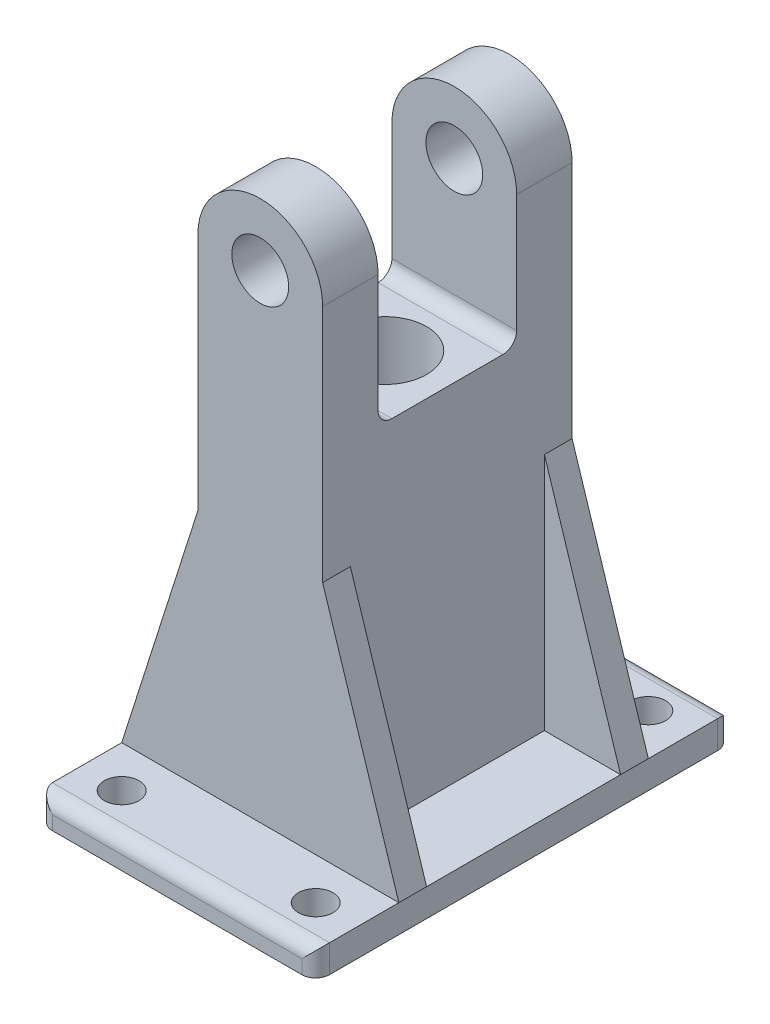
ISO-10303-21;
HEADER;
FILE_DESCRIPTION(('STEP AP214'),'2;1');
FILE_NAME('part.step','',(''),(''),'','','');
FILE_SCHEMA(('AUTOMOTIVE_DESIGN { 1 0 10303 214 1 1 1 1 }'));
ENDSEC;
DATA;
#1=APPLICATION_CONTEXT('core data for automotive mechanical design processes');
#2=APPLICATION_PROTOCOL_DEFINITION('international standard','automotive_design',2000,#1);
#3=PRODUCT_CONTEXT('',#1,'mechanical');
#4=PRODUCT('Part','Part','',(#3));
#5=PRODUCT_RELATED_PRODUCT_CATEGORY('part','',(#4));
#6=PRODUCT_DEFINITION_FORMATION('','',#4);
#7=PRODUCT_DEFINITION_CONTEXT('part definition',#1,'design');
#8=PRODUCT_DEFINITION('design','',#6,#7);
#9=PRODUCT_DEFINITION_SHAPE('','',#8);
#10=(LENGTH_UNIT() NAMED_UNIT(*) SI_UNIT(.MILLI.,.METRE.));
#11=(NAMED_UNIT(*) PLANE_ANGLE_UNIT() SI_UNIT($,.RADIAN.));
#12=(NAMED_UNIT(*) SI_UNIT($,.STERADIAN.) SOLID_ANGLE_UNIT());
#13=UNCERTAINTY_MEASURE_WITH_UNIT(LENGTH_MEASURE(1.E-05),#10,'distance_accuracy_value','');
#14=(GEOMETRIC_REPRESENTATION_CONTEXT(3) GLOBAL_UNCERTAINTY_ASSIGNED_CONTEXT((#13)) GLOBAL_UNIT_ASSIGNED_CONTEXT((#10,
#11,#12)) REPRESENTATION_CONTEXT('',''));
#15=CARTESIAN_POINT('',(0.,0.,0.));
#16=DIRECTION('',(0.,0.,1.));
#17=DIRECTION('',(1.,0.,0.));
#18=AXIS2_PLACEMENT_3D('',#15,#16,#17);
#19=CARTESIAN_POINT('',(0.,-69.,0.));
#20=DIRECTION('',(0.,-1.,0.));
#21=DIRECTION('',(0.,0.,-1.));
#22=AXIS2_PLACEMENT_3D('',#19,#20,#21);
#23=PLANE('',#22);
#24=DIRECTION('',(1.,0.,0.));
#25=VECTOR('',#24,1.);
#26=CARTESIAN_POINT('',(0.,-69.,-14.));
#27=LINE('',#26,#25);
#28=CARTESIAN_POINT('',(8.99999999999999,-69.,-14.));
#29=VERTEX_POINT('',#28);
#30=CARTESIAN_POINT('',(20.,-69.,-14.));
#31=VERTEX_POINT('',#30);
#32=EDGE_CURVE('E223',#29,#31,#27,.T.);
#33=ORIENTED_EDGE('',*,*,#32,.F.);
#34=DIRECTION('',(0.,0.,-1.));
#35=VECTOR('',#34,1.);
#36=CARTESIAN_POINT('',(8.99999999999999,-69.,-18.));
#37=LINE('',#36,#35);
#38=CARTESIAN_POINT('',(8.99999999999999,-69.,14.));
#39=VERTEX_POINT('',#38);
#40=EDGE_CURVE('E244',#39,#29,#37,.T.);
#41=ORIENTED_EDGE('',*,*,#40,.F.);
#42=DIRECTION('',(-1.,0.,0.));
#43=VECTOR('',#42,1.);
#44=CARTESIAN_POINT('',(0.,-69.,14.));
#45=LINE('',#44,#43);
#46=CARTESIAN_POINT('',(20.,-69.,14.));
#47=VERTEX_POINT('',#46);
#48=EDGE_CURVE('E286',#47,#39,#45,.T.);
#49=ORIENTED_EDGE('',*,*,#48,.F.);
#50=DIRECTION('',(0.,0.,1.));
#51=VECTOR('',#50,1.);
#52=CARTESIAN_POINT('',(20.,-69.,-30.));
#53=LINE('',#52,#51);
#54=EDGE_CURVE('E373',#31,#47,#53,.T.);
#55=ORIENTED_EDGE('',*,*,#54,.F.);
#56=EDGE_LOOP('',(#33,#41,#49,#55));
#57=FACE_BOUND('',#56,.T.);
#58=ADVANCED_FACE('F39',(#57),#23,.F.);
#59=CARTESIAN_POINT('',(8.99999999999999,-73.,-18.));
#60=DIRECTION('',(1.,0.,0.));
#61=DIRECTION('',(0.,1.,0.));
#62=AXIS2_PLACEMENT_3D('',#59,#60,#61);
#63=PLANE('',#62);
#64=DIRECTION('',(0.,-1.,0.));
#65=VECTOR('',#64,1.);
#66=CARTESIAN_POINT('',(9.,0.,-14.));
#67=LINE('',#66,#65);
#68=CARTESIAN_POINT('',(8.99999999999999,-34.5,-14.));
#69=VERTEX_POINT('',#68);
#70=EDGE_CURVE('E221',#69,#29,#67,.T.);
#71=ORIENTED_EDGE('',*,*,#70,.F.);
#72=DIRECTION('',(0.,0.,-1.));
#73=VECTOR('',#72,1.);
#74=CARTESIAN_POINT('',(8.99999999999999,-34.5,-14.));
#75=LINE('',#74,#73);
#76=CARTESIAN_POINT('',(8.99999999999999,-34.5,-18.));
#77=VERTEX_POINT('',#76);
#78=EDGE_CURVE('E231',#69,#77,#75,.T.);
#79=ORIENTED_EDGE('',*,*,#78,.T.);
#80=DIRECTION('',(0.,1.,0.));
#81=VECTOR('',#80,1.);
#82=CARTESIAN_POINT('',(8.99999999999999,-73.,-18.));
#83=LINE('',#82,#81);
#84=CARTESIAN_POINT('',(9.,0.,-18.));
#85=VERTEX_POINT('',#84);
#86=EDGE_CURVE('E424',#77,#85,#83,.T.);
#87=ORIENTED_EDGE('',*,*,#86,.T.);
#88=DIRECTION('',(0.,0.,1.));
#89=VECTOR('',#88,1.);
#90=CARTESIAN_POINT('',(9.,0.,-18.));
#91=LINE('',#90,#89);
#92=CARTESIAN_POINT('',(8.99999999999999,0.,-10.));
#93=VERTEX_POINT('',#92);
#94=EDGE_CURVE('E428',#85,#93,#91,.T.);
#95=ORIENTED_EDGE('',*,*,#94,.T.);
#96=DIRECTION('',(0.,-1.,0.));
#97=VECTOR('',#96,1.);
#98=CARTESIAN_POINT('',(8.99999999999999,9.,-10.));
#99=LINE('',#98,#97);
#100=CARTESIAN_POINT('',(8.99999999999999,-17.,-10.));
#101=VERTEX_POINT('',#100);
#102=EDGE_CURVE('E350',#93,#101,#99,.T.);
#103=ORIENTED_EDGE('',*,*,#102,.T.);
#104=CARTESIAN_POINT('',(9.,-17.,-8.));
#105=DIRECTION('',(1.,0.,0.));
#106=DIRECTION('',(0.,1.,0.));
#107=AXIS2_PLACEMENT_3D('',#104,#105,#106);
#108=CIRCLE('',#107,2.);
#109=CARTESIAN_POINT('',(8.99999999999999,-19.,-8.));
#110=VERTEX_POINT('',#109);
#111=EDGE_CURVE('E511',#101,#110,#108,.F.);
#112=ORIENTED_EDGE('',*,*,#111,.T.);
#113=DIRECTION('',(0.,0.,-1.));
#114=VECTOR('',#113,1.);
#115=CARTESIAN_POINT('',(8.99999999999999,-19.,10.));
#116=LINE('',#115,#114);
#117=CARTESIAN_POINT('',(8.99999999999999,-19.,8.));
#118=VERTEX_POINT('',#117);
#119=EDGE_CURVE('E327',#118,#110,#116,.T.);
#120=ORIENTED_EDGE('',*,*,#119,.F.);
#121=CARTESIAN_POINT('',(9.,-17.,8.));
#122=DIRECTION('',(1.,0.,0.));
#123=DIRECTION('',(0.,1.,0.));
#124=AXIS2_PLACEMENT_3D('',#121,#122,#123);
#125=CIRCLE('',#124,2.);
#126=CARTESIAN_POINT('',(8.99999999999999,-17.,10.));
#127=VERTEX_POINT('',#126);
#128=EDGE_CURVE('E49',#118,#127,#125,.F.);
#129=ORIENTED_EDGE('',*,*,#128,.T.);
#130=DIRECTION('',(0.,-1.,0.));
#131=VECTOR('',#130,1.);
#132=CARTESIAN_POINT('',(8.99999999999999,9.,10.));
#133=LINE('',#132,#131);
#134=CARTESIAN_POINT('',(8.99999999999999,0.,10.));
#135=VERTEX_POINT('',#134);
#136=EDGE_CURVE('E338',#135,#127,#133,.T.);
#137=ORIENTED_EDGE('',*,*,#136,.F.);
#138=CARTESIAN_POINT('',(9.,0.,18.));
#139=VERTEX_POINT('',#138);
#140=EDGE_CURVE('E433',#135,#139,#91,.T.);
#141=ORIENTED_EDGE('',*,*,#140,.T.);
#142=DIRECTION('',(0.,1.,0.));
#143=VECTOR('',#142,1.);
#144=CARTESIAN_POINT('',(8.99999999999999,-73.,18.));
#145=LINE('',#144,#143);
#146=CARTESIAN_POINT('',(9.,-34.5,18.));
#147=VERTEX_POINT('',#146);
#148=EDGE_CURVE('E409',#147,#139,#145,.T.);
#149=ORIENTED_EDGE('',*,*,#148,.F.);
#150=DIRECTION('',(0.,0.,1.));
#151=VECTOR('',#150,1.);
#152=CARTESIAN_POINT('',(9.,-34.5,14.));
#153=LINE('',#152,#151);
#154=CARTESIAN_POINT('',(9.,-34.5,14.));
#155=VERTEX_POINT('',#154);
#156=EDGE_CURVE('E296',#155,#147,#153,.T.);
#157=ORIENTED_EDGE('',*,*,#156,.F.);
#158=DIRECTION('',(0.,1.,0.));
#159=VECTOR('',#158,1.);
#160=CARTESIAN_POINT('',(9.,0.,14.));
#161=LINE('',#160,#159);
#162=EDGE_CURVE('E278',#39,#155,#161,.T.);
#163=ORIENTED_EDGE('',*,*,#162,.F.);
#164=ORIENTED_EDGE('',*,*,#40,.T.);
#165=EDGE_LOOP('',(#71,#79,#87,#95,#103,#112,#120,#129,#137,#141,#149,#157,#163,#164));
#166=FACE_BOUND('',#165,.T.);
#167=ADVANCED_FACE('F241',(#166),#63,.T.);
#168=DIRECTION('',(1.,0.,0.));
#169=VECTOR('',#168,1.);
#170=CARTESIAN_POINT('',(0.,-69.,-14.));
#171=LINE('',#170,#169);
#172=CARTESIAN_POINT('',(-20.,-69.,-14.));
#173=VERTEX_POINT('',#172);
#174=CARTESIAN_POINT('',(-9.,-69.,-14.));
#175=VERTEX_POINT('',#174);
#176=EDGE_CURVE('E263',#173,#175,#171,.T.);
#177=ORIENTED_EDGE('',*,*,#176,.F.);
#178=DIRECTION('',(0.,0.,-1.));
#179=VECTOR('',#178,1.);
#180=CARTESIAN_POINT('',(-20.,-69.,-30.));
#181=LINE('',#180,#179);
#182=CARTESIAN_POINT('',(-20.,-69.,14.));
#183=VERTEX_POINT('',#182);
#184=EDGE_CURVE('E367',#183,#173,#181,.T.);
#185=ORIENTED_EDGE('',*,*,#184,.F.);
#186=DIRECTION('',(-1.,0.,0.));
#187=VECTOR('',#186,1.);
#188=CARTESIAN_POINT('',(0.,-69.,14.));
#189=LINE('',#188,#187);
#190=CARTESIAN_POINT('',(-9.,-69.,14.));
#191=VERTEX_POINT('',#190);
#192=EDGE_CURVE('E308',#191,#183,#189,.T.);
#193=ORIENTED_EDGE('',*,*,#192,.F.);
#194=DIRECTION('',(0.,0.,1.));
#195=VECTOR('',#194,1.);
#196=CARTESIAN_POINT('',(-8.99999999999999,-69.,-18.));
#197=LINE('',#196,#195);
#198=EDGE_CURVE('E372',#175,#191,#197,.T.);
#199=ORIENTED_EDGE('',*,*,#198,.F.);
#200=EDGE_LOOP('',(#177,#185,#193,#199));
#201=FACE_BOUND('',#200,.T.);
#202=ADVANCED_FACE('F628',(#201),#23,.F.);
#203=CARTESIAN_POINT('',(-9.,0.,-18.));
#204=DIRECTION('',(-1.,0.,0.));
#205=DIRECTION('',(0.,-1.,0.));
#206=AXIS2_PLACEMENT_3D('',#203,#204,#205);
#207=PLANE('',#206);
#208=DIRECTION('',(0.,-1.,0.));
#209=VECTOR('',#208,1.);
#210=CARTESIAN_POINT('',(-9.,0.,-18.));
#211=LINE('',#210,#209);
#212=CARTESIAN_POINT('',(-9.,0.,-18.));
#213=VERTEX_POINT('',#212);
#214=CARTESIAN_POINT('',(-9.00000000000001,-34.5,-18.));
#215=VERTEX_POINT('',#214);
#216=EDGE_CURVE('E420',#213,#215,#211,.T.);
#217=ORIENTED_EDGE('',*,*,#216,.T.);
#218=DIRECTION('',(0.,0.,-1.));
#219=VECTOR('',#218,1.);
#220=CARTESIAN_POINT('',(-9.00000000000001,-34.5,-14.));
#221=LINE('',#220,#219);
#222=CARTESIAN_POINT('',(-9.00000000000001,-34.5,-14.));
#223=VERTEX_POINT('',#222);
#224=EDGE_CURVE('E273',#223,#215,#221,.T.);
#225=ORIENTED_EDGE('',*,*,#224,.F.);
#226=DIRECTION('',(0.,1.,0.));
#227=VECTOR('',#226,1.);
#228=CARTESIAN_POINT('',(-9.,0.,-14.));
#229=LINE('',#228,#227);
#230=EDGE_CURVE('E256',#175,#223,#229,.T.);
#231=ORIENTED_EDGE('',*,*,#230,.F.);
#232=ORIENTED_EDGE('',*,*,#198,.T.);
#233=DIRECTION('',(0.,-1.,0.));
#234=VECTOR('',#233,1.);
#235=CARTESIAN_POINT('',(-9.,0.,14.));
#236=LINE('',#235,#234);
#237=CARTESIAN_POINT('',(-9.,-34.5,14.));
#238=VERTEX_POINT('',#237);
#239=EDGE_CURVE('E304',#238,#191,#236,.T.);
#240=ORIENTED_EDGE('',*,*,#239,.F.);
#241=DIRECTION('',(0.,0.,1.));
#242=VECTOR('',#241,1.);
#243=CARTESIAN_POINT('',(-9.,-34.5,14.));
#244=LINE('',#243,#242);
#245=CARTESIAN_POINT('',(-9.,-34.5,18.));
#246=VERTEX_POINT('',#245);
#247=EDGE_CURVE('E318',#238,#246,#244,.T.);
#248=ORIENTED_EDGE('',*,*,#247,.T.);
#249=DIRECTION('',(0.,-1.,0.));
#250=VECTOR('',#249,1.);
#251=CARTESIAN_POINT('',(-9.,0.,18.));
#252=LINE('',#251,#250);
#253=CARTESIAN_POINT('',(-9.,0.,18.));
#254=VERTEX_POINT('',#253);
#255=EDGE_CURVE('E405',#254,#246,#252,.T.);
#256=ORIENTED_EDGE('',*,*,#255,.F.);
#257=DIRECTION('',(0.,0.,1.));
#258=VECTOR('',#257,1.);
#259=CARTESIAN_POINT('',(-9.,0.,-18.));
#260=LINE('',#259,#258);
#261=CARTESIAN_POINT('',(-9.,0.,10.));
#262=VERTEX_POINT('',#261);
#263=EDGE_CURVE('E427',#262,#254,#260,.T.);
#264=ORIENTED_EDGE('',*,*,#263,.F.);
#265=DIRECTION('',(0.,-1.,0.));
#266=VECTOR('',#265,1.);
#267=CARTESIAN_POINT('',(-8.99999999999999,9.,10.));
#268=LINE('',#267,#266);
#269=CARTESIAN_POINT('',(-8.99999999999999,-17.,10.));
#270=VERTEX_POINT('',#269);
#271=EDGE_CURVE('E342',#262,#270,#268,.T.);
#272=ORIENTED_EDGE('',*,*,#271,.T.);
#273=CARTESIAN_POINT('',(-9.,-17.,8.));
#274=DIRECTION('',(-1.,0.,0.));
#275=DIRECTION('',(0.,-1.,0.));
#276=AXIS2_PLACEMENT_3D('',#273,#274,#275);
#277=CIRCLE('',#276,2.);
#278=CARTESIAN_POINT('',(-8.99999999999999,-19.,8.));
#279=VERTEX_POINT('',#278);
#280=EDGE_CURVE('E11',#270,#279,#277,.F.);
#281=ORIENTED_EDGE('',*,*,#280,.T.);
#282=DIRECTION('',(0.,0.,1.));
#283=VECTOR('',#282,1.);
#284=CARTESIAN_POINT('',(-8.99999999999999,-19.,10.));
#285=LINE('',#284,#283);
#286=CARTESIAN_POINT('',(-8.99999999999999,-19.,-8.));
#287=VERTEX_POINT('',#286);
#288=EDGE_CURVE('E334',#287,#279,#285,.T.);
#289=ORIENTED_EDGE('',*,*,#288,.F.);
#290=CARTESIAN_POINT('',(-9.,-17.,-8.));
#291=DIRECTION('',(-1.,0.,0.));
#292=DIRECTION('',(0.,-1.,0.));
#293=AXIS2_PLACEMENT_3D('',#290,#291,#292);
#294=CIRCLE('',#293,2.);
#295=CARTESIAN_POINT('',(-8.99999999999999,-17.,-10.));
#296=VERTEX_POINT('',#295);
#297=EDGE_CURVE('E508',#287,#296,#294,.F.);
#298=ORIENTED_EDGE('',*,*,#297,.T.);
#299=DIRECTION('',(0.,-1.,0.));
#300=VECTOR('',#299,1.);
#301=CARTESIAN_POINT('',(-8.99999999999999,9.,-10.));
#302=LINE('',#301,#300);
#303=CARTESIAN_POINT('',(-8.99999999999999,0.,-10.));
#304=VERTEX_POINT('',#303);
#305=EDGE_CURVE('E346',#304,#296,#302,.T.);
#306=ORIENTED_EDGE('',*,*,#305,.F.);
#307=EDGE_CURVE('E434',#213,#304,#260,.T.);
#308=ORIENTED_EDGE('',*,*,#307,.F.);
#309=EDGE_LOOP('',(#217,#225,#231,#232,#240,#248,#256,#264,#272,#281,#289,#298,#306,#308));
#310=FACE_BOUND('',#309,.T.);
#311=ADVANCED_FACE('F575',(#310),#207,.T.);
#312=CARTESIAN_POINT('',(14.,-69.,-24.));
#313=DIRECTION('',(0.,1.,0.));
#314=DIRECTION('',(0.,0.,1.));
#315=AXIS2_PLACEMENT_3D('',#312,#313,#314);
#316=CIRCLE('',#315,2.5);
#317=CARTESIAN_POINT('',(14.,-69.,-21.5));
#318=VERTEX_POINT('',#317);
#319=EDGE_CURVE('E1040',#318,#318,#316,.T.);
#320=ORIENTED_EDGE('',*,*,#319,.F.);
#321=EDGE_LOOP('',(#320));
#322=FACE_BOUND('',#321,.T.);
#323=CARTESIAN_POINT('',(-14.,-69.,-24.));
#324=DIRECTION('',(0.,1.,0.));
#325=DIRECTION('',(0.,0.,-1.));
#326=AXIS2_PLACEMENT_3D('',#323,#324,#325);
#327=CIRCLE('',#326,2.5);
#328=CARTESIAN_POINT('',(-14.,-69.,-26.5));
#329=VERTEX_POINT('',#328);
#330=EDGE_CURVE('E1031',#329,#329,#327,.T.);
#331=ORIENTED_EDGE('',*,*,#330,.F.);
#332=EDGE_LOOP('',(#331));
#333=FACE_BOUND('',#332,.T.);
#334=CARTESIAN_POINT('',(20.,-69.,-28.));
#335=VERTEX_POINT('',#334);
#336=CARTESIAN_POINT('',(20.,-69.,-18.));
#337=VERTEX_POINT('',#336);
#338=EDGE_CURVE('E369',#335,#337,#53,.T.);
#339=ORIENTED_EDGE('',*,*,#338,.F.);
#340=DIRECTION('',(1.,0.,0.));
#341=VECTOR('',#340,1.);
#342=CARTESIAN_POINT('',(-20.,-69.,-28.));
#343=LINE('',#342,#341);
#344=CARTESIAN_POINT('',(-20.,-69.,-28.));
#345=VERTEX_POINT('',#344);
#346=EDGE_CURVE('E488',#335,#345,#343,.F.);
#347=ORIENTED_EDGE('',*,*,#346,.T.);
#348=CARTESIAN_POINT('',(-20.,-69.,-18.));
#349=VERTEX_POINT('',#348);
#350=EDGE_CURVE('E368',#349,#345,#181,.T.);
#351=ORIENTED_EDGE('',*,*,#350,.F.);
#352=DIRECTION('',(1.,0.,0.));
#353=VECTOR('',#352,1.);
#354=CARTESIAN_POINT('',(0.,-69.,-18.));
#355=LINE('',#354,#353);
#356=EDGE_CURVE('E393',#349,#337,#355,.T.);
#357=ORIENTED_EDGE('',*,*,#356,.T.);
#358=EDGE_LOOP('',(#339,#347,#351,#357));
#359=FACE_BOUND('',#358,.T.);
#360=ADVANCED_FACE('F549',(#322,#333,#359),#23,.F.);
#361=CARTESIAN_POINT('',(14.,-69.,24.));
#362=DIRECTION('',(0.,1.,0.));
#363=DIRECTION('',(0.,0.,-1.));
#364=AXIS2_PLACEMENT_3D('',#361,#362,#363);
#365=CIRCLE('',#364,2.5);
#366=CARTESIAN_POINT('',(14.,-69.,21.5));
#367=VERTEX_POINT('',#366);
#368=EDGE_CURVE('E523',#367,#367,#365,.T.);
#369=ORIENTED_EDGE('',*,*,#368,.F.);
#370=EDGE_LOOP('',(#369));
#371=FACE_BOUND('',#370,.T.);
#372=CARTESIAN_POINT('',(-14.,-69.,24.));
#373=DIRECTION('',(0.,1.,0.));
#374=DIRECTION('',(0.,0.,1.));
#375=AXIS2_PLACEMENT_3D('',#372,#373,#374);
#376=CIRCLE('',#375,2.5);
#377=CARTESIAN_POINT('',(-14.,-69.,26.5));
#378=VERTEX_POINT('',#377);
#379=EDGE_CURVE('E652',#378,#378,#376,.T.);
#380=ORIENTED_EDGE('',*,*,#379,.F.);
#381=EDGE_LOOP('',(#380));
#382=FACE_BOUND('',#381,.T.);
#383=CARTESIAN_POINT('',(-20.,-69.,28.));
#384=VERTEX_POINT('',#383);
#385=CARTESIAN_POINT('',(-20.,-69.,18.));
#386=VERTEX_POINT('',#385);
#387=EDGE_CURVE('E363',#384,#386,#181,.T.);
#388=ORIENTED_EDGE('',*,*,#387,.F.);
#389=DIRECTION('',(-1.,0.,0.));
#390=VECTOR('',#389,1.);
#391=CARTESIAN_POINT('',(20.,-69.,28.));
#392=LINE('',#391,#390);
#393=CARTESIAN_POINT('',(20.,-69.,28.));
#394=VERTEX_POINT('',#393);
#395=EDGE_CURVE('E505',#384,#394,#392,.F.);
#396=ORIENTED_EDGE('',*,*,#395,.T.);
#397=CARTESIAN_POINT('',(20.,-69.,18.));
#398=VERTEX_POINT('',#397);
#399=EDGE_CURVE('E366',#398,#394,#53,.T.);
#400=ORIENTED_EDGE('',*,*,#399,.F.);
#401=DIRECTION('',(1.,0.,0.));
#402=VECTOR('',#401,1.);
#403=CARTESIAN_POINT('',(0.,-69.,18.));
#404=LINE('',#403,#402);
#405=EDGE_CURVE('E432',#386,#398,#404,.T.);
#406=ORIENTED_EDGE('',*,*,#405,.F.);
#407=EDGE_LOOP('',(#388,#396,#400,#406));
#408=FACE_BOUND('',#407,.T.);
#409=ADVANCED_FACE('F629',(#371,#382,#408),#23,.F.);
#410=CARTESIAN_POINT('',(0.,0.,-18.));
#411=DIRECTION('',(0.,0.,1.));
#412=DIRECTION('',(1.,0.,0.));
#413=AXIS2_PLACEMENT_3D('',#410,#411,#412);
#414=CYLINDRICAL_SURFACE('',#413,9.);
#415=ORIENTED_EDGE('',*,*,#307,.T.);
#416=CARTESIAN_POINT('',(0.,0.,-10.));
#417=DIRECTION('',(0.,0.,1.));
#418=DIRECTION('',(1.,0.,0.));
#419=AXIS2_PLACEMENT_3D('',#416,#417,#418);
#420=CIRCLE('',#419,9.);
#421=EDGE_CURVE('E359',#304,#93,#420,.F.);
#422=ORIENTED_EDGE('',*,*,#421,.T.);
#423=ORIENTED_EDGE('',*,*,#94,.F.);
#424=CARTESIAN_POINT('',(0.,0.,-18.));
#425=DIRECTION('',(0.,0.,1.));
#426=DIRECTION('',(1.,0.,0.));
#427=AXIS2_PLACEMENT_3D('',#424,#425,#426);
#428=CIRCLE('',#427,9.);
#429=EDGE_CURVE('E416',#85,#213,#428,.T.);
#430=ORIENTED_EDGE('',*,*,#429,.T.);
#431=EDGE_LOOP('',(#415,#422,#423,#430));
#432=FACE_BOUND('',#431,.T.);
#433=ADVANCED_FACE('F558',(#432),#414,.T.);
#434=ORIENTED_EDGE('',*,*,#140,.F.);
#435=CARTESIAN_POINT('',(0.,0.,10.));
#436=DIRECTION('',(0.,0.,-1.));
#437=DIRECTION('',(-1.,0.,0.));
#438=AXIS2_PLACEMENT_3D('',#435,#436,#437);
#439=CIRCLE('',#438,9.);
#440=EDGE_CURVE('E355',#135,#262,#439,.F.);
#441=ORIENTED_EDGE('',*,*,#440,.T.);
#442=ORIENTED_EDGE('',*,*,#263,.T.);
#443=CARTESIAN_POINT('',(0.,0.,18.));
#444=DIRECTION('',(0.,0.,1.));
#445=DIRECTION('',(1.,0.,0.));
#446=AXIS2_PLACEMENT_3D('',#443,#444,#445);
#447=CIRCLE('',#446,9.);
#448=EDGE_CURVE('E401',#139,#254,#447,.T.);
#449=ORIENTED_EDGE('',*,*,#448,.F.);
#450=EDGE_LOOP('',(#434,#441,#442,#449));
#451=FACE_BOUND('',#450,.T.);
#452=ADVANCED_FACE('F589',(#451),#414,.T.);
#453=CARTESIAN_POINT('',(0.,0.,-18.));
#454=DIRECTION('',(0.,0.,1.));
#455=DIRECTION('',(1.,0.,0.));
#456=AXIS2_PLACEMENT_3D('',#453,#454,#455);
#457=CYLINDRICAL_SURFACE('',#456,4.1);
#458=CARTESIAN_POINT('',(0.,0.,-18.));
#459=DIRECTION('',(0.,0.,1.));
#460=DIRECTION('',(1.,0.,0.));
#461=AXIS2_PLACEMENT_3D('',#458,#459,#460);
#462=CIRCLE('',#461,4.1);
#463=CARTESIAN_POINT('',(4.1,0.,-18.));
#464=VERTEX_POINT('',#463);
#465=EDGE_CURVE('E412',#464,#464,#462,.T.);
#466=ORIENTED_EDGE('',*,*,#465,.F.);
#467=EDGE_LOOP('',(#466));
#468=FACE_BOUND('',#467,.T.);
#469=CARTESIAN_POINT('',(0.,0.,-10.));
#470=DIRECTION('',(0.,0.,1.));
#471=DIRECTION('',(1.,0.,0.));
#472=AXIS2_PLACEMENT_3D('',#469,#470,#471);
#473=CIRCLE('',#472,4.1);
#474=CARTESIAN_POINT('',(4.1,0.,-10.));
#475=VERTEX_POINT('',#474);
#476=EDGE_CURVE('E358',#475,#475,#473,.F.);
#477=ORIENTED_EDGE('',*,*,#476,.F.);
#478=EDGE_LOOP('',(#477));
#479=FACE_BOUND('',#478,.T.);
#480=ADVANCED_FACE('F671',(#468,#479),#457,.F.);
#481=CARTESIAN_POINT('',(0.,0.,18.));
#482=DIRECTION('',(0.,0.,1.));
#483=DIRECTION('',(1.,0.,0.));
#484=AXIS2_PLACEMENT_3D('',#481,#482,#483);
#485=CIRCLE('',#484,4.1);
#486=CARTESIAN_POINT('',(4.1,0.,18.));
#487=VERTEX_POINT('',#486);
#488=EDGE_CURVE('E397',#487,#487,#485,.T.);
#489=ORIENTED_EDGE('',*,*,#488,.T.);
#490=EDGE_LOOP('',(#489));
#491=FACE_BOUND('',#490,.T.);
#492=CARTESIAN_POINT('',(0.,0.,10.));
#493=DIRECTION('',(0.,0.,-1.));
#494=DIRECTION('',(-1.,0.,0.));
#495=AXIS2_PLACEMENT_3D('',#492,#493,#494);
#496=CIRCLE('',#495,4.1);
#497=CARTESIAN_POINT('',(-4.1,0.,10.));
#498=VERTEX_POINT('',#497);
#499=EDGE_CURVE('E354',#498,#498,#496,.F.);
#500=ORIENTED_EDGE('',*,*,#499,.F.);
#501=EDGE_LOOP('',(#500));
#502=FACE_BOUND('',#501,.T.);
#503=ADVANCED_FACE('F674',(#491,#502),#457,.F.);
#504=CARTESIAN_POINT('',(0.,0.,-18.));
#505=DIRECTION('',(0.,0.,1.));
#506=DIRECTION('',(1.,0.,0.));
#507=AXIS2_PLACEMENT_3D('',#504,#505,#506);
#508=PLANE('',#507);
#509=ORIENTED_EDGE('',*,*,#465,.T.);
#510=EDGE_LOOP('',(#509));
#511=FACE_BOUND('',#510,.T.);
#512=ORIENTED_EDGE('',*,*,#356,.F.);
#513=DIRECTION('',(-0.303773534632601,-0.952744267711339,0.));
#514=VECTOR('',#513,1.);
#515=CARTESIAN_POINT('',(1.81544327931362,-0.578836987607242,-18.));
#516=LINE('',#515,#514);
#517=EDGE_CURVE('E237',#215,#349,#516,.T.);
#518=ORIENTED_EDGE('',*,*,#517,.F.);
#519=ORIENTED_EDGE('',*,*,#216,.F.);
#520=ORIENTED_EDGE('',*,*,#429,.F.);
#521=ORIENTED_EDGE('',*,*,#86,.F.);
#522=DIRECTION('',(-0.303773534632601,0.952744267711339,0.));
#523=VECTOR('',#522,1.);
#524=CARTESIAN_POINT('',(-1.81544327931365,-0.578836987607252,-18.));
#525=LINE('',#524,#523);
#526=EDGE_CURVE('E228',#337,#77,#525,.T.);
#527=ORIENTED_EDGE('',*,*,#526,.F.);
#528=EDGE_LOOP('',(#512,#518,#519,#520,#521,#527));
#529=FACE_BOUND('',#528,.T.);
#530=ADVANCED_FACE('F553',(#511,#529),#508,.F.);
#531=CARTESIAN_POINT('',(0.,0.,18.));
#532=DIRECTION('',(0.,0.,1.));
#533=DIRECTION('',(1.,0.,0.));
#534=AXIS2_PLACEMENT_3D('',#531,#532,#533);
#535=PLANE('',#534);
#536=ORIENTED_EDGE('',*,*,#488,.F.);
#537=EDGE_LOOP('',(#536));
#538=FACE_BOUND('',#537,.T.);
#539=ORIENTED_EDGE('',*,*,#255,.T.);
#540=DIRECTION('',(0.303773534632601,0.952744267711339,0.));
#541=VECTOR('',#540,1.);
#542=CARTESIAN_POINT('',(1.81544327931362,-0.578836987607242,18.));
#543=LINE('',#542,#541);
#544=EDGE_CURVE('E300',#386,#246,#543,.T.);
#545=ORIENTED_EDGE('',*,*,#544,.F.);
#546=ORIENTED_EDGE('',*,*,#405,.T.);
#547=DIRECTION('',(0.303773534632601,-0.952744267711339,0.));
#548=VECTOR('',#547,1.);
#549=CARTESIAN_POINT('',(-1.81544327931365,-0.578836987607252,18.));
#550=LINE('',#549,#548);
#551=EDGE_CURVE('E277',#147,#398,#550,.T.);
#552=ORIENTED_EDGE('',*,*,#551,.F.);
#553=ORIENTED_EDGE('',*,*,#148,.T.);
#554=ORIENTED_EDGE('',*,*,#448,.T.);
#555=EDGE_LOOP('',(#539,#545,#546,#552,#553,#554));
#556=FACE_BOUND('',#555,.T.);
#557=ADVANCED_FACE('F664',(#538,#556),#535,.T.);
#558=CARTESIAN_POINT('',(-20.,-69.,-30.));
#559=DIRECTION('',(-1.,0.,0.));
#560=DIRECTION('',(0.,0.,1.));
#561=AXIS2_PLACEMENT_3D('',#558,#559,#560);
#562=PLANE('',#561);
#563=ORIENTED_EDGE('',*,*,#350,.T.);
#564=DIRECTION('',(0.,-1.,0.));
#565=VECTOR('',#564,1.);
#566=CARTESIAN_POINT('',(-20.,-69.,-28.));
#567=LINE('',#566,#565);
#568=CARTESIAN_POINT('',(-20.,-73.,-28.));
#569=VERTEX_POINT('',#568);
#570=EDGE_CURVE('E463',#345,#569,#567,.T.);
#571=ORIENTED_EDGE('',*,*,#570,.T.);
#572=DIRECTION('',(0.,0.,-1.));
#573=VECTOR('',#572,1.);
#574=CARTESIAN_POINT('',(-20.,-73.,-30.));
#575=LINE('',#574,#573);
#576=CARTESIAN_POINT('',(-20.,-73.,28.));
#577=VERTEX_POINT('',#576);
#578=EDGE_CURVE('E362',#577,#569,#575,.T.);
#579=ORIENTED_EDGE('',*,*,#578,.F.);
#580=DIRECTION('',(0.,-1.,0.));
#581=VECTOR('',#580,1.);
#582=CARTESIAN_POINT('',(-20.,-69.,28.));
#583=LINE('',#582,#581);
#584=EDGE_CURVE('E460',#577,#384,#583,.F.);
#585=ORIENTED_EDGE('',*,*,#584,.T.);
#586=ORIENTED_EDGE('',*,*,#387,.T.);
#587=DIRECTION('',(0.,0.,1.));
#588=VECTOR('',#587,1.);
#589=CARTESIAN_POINT('',(-20.,-69.,14.));
#590=LINE('',#589,#588);
#591=EDGE_CURVE('E312',#183,#386,#590,.T.);
#592=ORIENTED_EDGE('',*,*,#591,.F.);
#593=ORIENTED_EDGE('',*,*,#184,.T.);
#594=DIRECTION('',(0.,0.,-1.));
#595=VECTOR('',#594,1.);
#596=CARTESIAN_POINT('',(-20.,-69.,-14.));
#597=LINE('',#596,#595);
#598=EDGE_CURVE('E266',#173,#349,#597,.T.);
#599=ORIENTED_EDGE('',*,*,#598,.T.);
#600=EDGE_LOOP('',(#563,#571,#579,#585,#586,#592,#593,#599));
#601=FACE_BOUND('',#600,.T.);
#602=ADVANCED_FACE('F602',(#601),#562,.T.);
#603=CARTESIAN_POINT('',(20.,-69.,30.));
#604=DIRECTION('',(0.,0.,1.));
#605=DIRECTION('',(1.,0.,0.));
#606=AXIS2_PLACEMENT_3D('',#603,#604,#605);
#607=PLANE('',#606);
#608=DIRECTION('',(-1.,0.,0.));
#609=VECTOR('',#608,1.);
#610=CARTESIAN_POINT('',(20.,-73.,30.));
#611=LINE('',#610,#609);
#612=CARTESIAN_POINT('',(18.,-73.,30.));
#613=VERTEX_POINT('',#612);
#614=CARTESIAN_POINT('',(-18.,-73.,30.));
#615=VERTEX_POINT('',#614);
#616=EDGE_CURVE('E385',#613,#615,#611,.T.);
#617=ORIENTED_EDGE('',*,*,#616,.F.);
#618=DIRECTION('',(0.,-1.,0.));
#619=VECTOR('',#618,1.);
#620=CARTESIAN_POINT('',(18.,-69.,30.));
#621=LINE('',#620,#619);
#622=CARTESIAN_POINT('',(18.,-71.,30.));
#623=VERTEX_POINT('',#622);
#624=EDGE_CURVE('E57',#613,#623,#621,.F.);
#625=ORIENTED_EDGE('',*,*,#624,.T.);
#626=DIRECTION('',(-1.,0.,0.));
#627=VECTOR('',#626,1.);
#628=CARTESIAN_POINT('',(-20.,-71.,30.));
#629=LINE('',#628,#627);
#630=CARTESIAN_POINT('',(-18.,-71.,30.));
#631=VERTEX_POINT('',#630);
#632=EDGE_CURVE('E500',#623,#631,#629,.T.);
#633=ORIENTED_EDGE('',*,*,#632,.T.);
#634=DIRECTION('',(0.,-1.,0.));
#635=VECTOR('',#634,1.);
#636=CARTESIAN_POINT('',(-18.,-69.,30.));
#637=LINE('',#636,#635);
#638=EDGE_CURVE('E497',#631,#615,#637,.T.);
#639=ORIENTED_EDGE('',*,*,#638,.T.);
#640=EDGE_LOOP('',(#617,#625,#633,#639));
#641=FACE_BOUND('',#640,.T.);
#642=ADVANCED_FACE('F622',(#641),#607,.T.);
#643=CARTESIAN_POINT('',(20.,-69.,-30.));
#644=DIRECTION('',(1.,0.,0.));
#645=DIRECTION('',(0.,0.,-1.));
#646=AXIS2_PLACEMENT_3D('',#643,#644,#645);
#647=PLANE('',#646);
#648=DIRECTION('',(0.,0.,1.));
#649=VECTOR('',#648,1.);
#650=CARTESIAN_POINT('',(20.,-73.,-30.));
#651=LINE('',#650,#649);
#652=CARTESIAN_POINT('',(20.,-73.,-28.));
#653=VERTEX_POINT('',#652);
#654=CARTESIAN_POINT('',(20.,-73.,28.));
#655=VERTEX_POINT('',#654);
#656=EDGE_CURVE('E381',#653,#655,#651,.T.);
#657=ORIENTED_EDGE('',*,*,#656,.F.);
#658=DIRECTION('',(0.,-1.,0.));
#659=VECTOR('',#658,1.);
#660=CARTESIAN_POINT('',(20.,-69.,-28.));
#661=LINE('',#660,#659);
#662=EDGE_CURVE('E494',#653,#335,#661,.F.);
#663=ORIENTED_EDGE('',*,*,#662,.T.);
#664=ORIENTED_EDGE('',*,*,#338,.T.);
#665=DIRECTION('',(0.,0.,-1.));
#666=VECTOR('',#665,1.);
#667=CARTESIAN_POINT('',(20.,-69.,-14.));
#668=LINE('',#667,#666);
#669=EDGE_CURVE('E238',#31,#337,#668,.T.);
#670=ORIENTED_EDGE('',*,*,#669,.F.);
#671=ORIENTED_EDGE('',*,*,#54,.T.);
#672=DIRECTION('',(0.,0.,1.));
#673=VECTOR('',#672,1.);
#674=CARTESIAN_POINT('',(20.,-69.,14.));
#675=LINE('',#674,#673);
#676=EDGE_CURVE('E289',#47,#398,#675,.T.);
#677=ORIENTED_EDGE('',*,*,#676,.T.);
#678=ORIENTED_EDGE('',*,*,#399,.T.);
#679=DIRECTION('',(0.,-1.,0.));
#680=VECTOR('',#679,1.);
#681=CARTESIAN_POINT('',(20.,-69.,28.));
#682=LINE('',#681,#680);
#683=EDGE_CURVE('E491',#394,#655,#682,.T.);
#684=ORIENTED_EDGE('',*,*,#683,.T.);
#685=EDGE_LOOP('',(#657,#663,#664,#670,#671,#677,#678,#684));
#686=FACE_BOUND('',#685,.T.);
#687=ADVANCED_FACE('F534',(#686),#647,.T.);
#688=CARTESIAN_POINT('',(20.,-69.,-30.));
#689=DIRECTION('',(0.,0.,-1.));
#690=DIRECTION('',(-1.,0.,0.));
#691=AXIS2_PLACEMENT_3D('',#688,#689,#690);
#692=PLANE('',#691);
#693=DIRECTION('',(1.,0.,0.));
#694=VECTOR('',#693,1.);
#695=CARTESIAN_POINT('',(20.,-73.,-30.));
#696=LINE('',#695,#694);
#697=CARTESIAN_POINT('',(-18.,-73.,-30.));
#698=VERTEX_POINT('',#697);
#699=CARTESIAN_POINT('',(18.,-73.,-30.));
#700=VERTEX_POINT('',#699);
#701=EDGE_CURVE('E377',#698,#700,#696,.T.);
#702=ORIENTED_EDGE('',*,*,#701,.F.);
#703=DIRECTION('',(0.,-1.,0.));
#704=VECTOR('',#703,1.);
#705=CARTESIAN_POINT('',(-18.,-69.,-30.));
#706=LINE('',#705,#704);
#707=CARTESIAN_POINT('',(-18.,-71.,-30.));
#708=VERTEX_POINT('',#707);
#709=EDGE_CURVE('E485',#698,#708,#706,.F.);
#710=ORIENTED_EDGE('',*,*,#709,.T.);
#711=DIRECTION('',(1.,0.,0.));
#712=VECTOR('',#711,1.);
#713=CARTESIAN_POINT('',(20.,-71.,-30.));
#714=LINE('',#713,#712);
#715=CARTESIAN_POINT('',(18.,-71.,-30.));
#716=VERTEX_POINT('',#715);
#717=EDGE_CURVE('E482',#708,#716,#714,.T.);
#718=ORIENTED_EDGE('',*,*,#717,.T.);
#719=DIRECTION('',(0.,-1.,0.));
#720=VECTOR('',#719,1.);
#721=CARTESIAN_POINT('',(18.,-69.,-30.));
#722=LINE('',#721,#720);
#723=EDGE_CURVE('E479',#716,#700,#722,.T.);
#724=ORIENTED_EDGE('',*,*,#723,.T.);
#725=EDGE_LOOP('',(#702,#710,#718,#724));
#726=FACE_BOUND('',#725,.T.);
#727=ADVANCED_FACE('F613',(#726),#692,.T.);
#728=CARTESIAN_POINT('',(-8.99999999999999,-73.,-18.));
#729=DIRECTION('',(0.,-1.,0.));
#730=DIRECTION('',(0.,0.,-1.));
#731=AXIS2_PLACEMENT_3D('',#728,#729,#730);
#732=PLANE('',#731);
#733=CARTESIAN_POINT('',(14.,-73.,24.));
#734=DIRECTION('',(0.,1.,0.));
#735=DIRECTION('',(0.,0.,-1.));
#736=AXIS2_PLACEMENT_3D('',#733,#734,#735);
#737=CIRCLE('',#736,2.5);
#738=CARTESIAN_POINT('',(14.,-73.,21.5));
#739=VERTEX_POINT('',#738);
#740=EDGE_CURVE('E1036',#739,#739,#737,.T.);
#741=ORIENTED_EDGE('',*,*,#740,.T.);
#742=EDGE_LOOP('',(#741));
#743=FACE_BOUND('',#742,.T.);
#744=CARTESIAN_POINT('',(14.,-73.,-24.));
#745=DIRECTION('',(0.,1.,0.));
#746=DIRECTION('',(0.,0.,1.));
#747=AXIS2_PLACEMENT_3D('',#744,#745,#746);
#748=CIRCLE('',#747,2.5);
#749=CARTESIAN_POINT('',(14.,-73.,-21.5));
#750=VERTEX_POINT('',#749);
#751=EDGE_CURVE('E1044',#750,#750,#748,.T.);
#752=ORIENTED_EDGE('',*,*,#751,.T.);
#753=EDGE_LOOP('',(#752));
#754=FACE_BOUND('',#753,.T.);
#755=CARTESIAN_POINT('',(-14.,-73.,-24.));
#756=DIRECTION('',(0.,1.,0.));
#757=DIRECTION('',(0.,0.,-1.));
#758=AXIS2_PLACEMENT_3D('',#755,#756,#757);
#759=CIRCLE('',#758,2.5);
#760=CARTESIAN_POINT('',(-14.,-73.,-26.5));
#761=VERTEX_POINT('',#760);
#762=EDGE_CURVE('E1026',#761,#761,#759,.T.);
#763=ORIENTED_EDGE('',*,*,#762,.T.);
#764=EDGE_LOOP('',(#763));
#765=FACE_BOUND('',#764,.T.);
#766=CARTESIAN_POINT('',(-14.,-73.,24.));
#767=DIRECTION('',(0.,1.,0.));
#768=DIRECTION('',(0.,0.,1.));
#769=AXIS2_PLACEMENT_3D('',#766,#767,#768);
#770=CIRCLE('',#769,2.5);
#771=CARTESIAN_POINT('',(-14.,-73.,26.5));
#772=VERTEX_POINT('',#771);
#773=EDGE_CURVE('E253',#772,#772,#770,.T.);
#774=ORIENTED_EDGE('',*,*,#773,.T.);
#775=EDGE_LOOP('',(#774));
#776=FACE_BOUND('',#775,.T.);
#777=CARTESIAN_POINT('',(0.,-73.,0.));
#778=DIRECTION('',(0.,1.,0.));
#779=DIRECTION('',(0.,0.,1.));
#780=AXIS2_PLACEMENT_3D('',#777,#778,#779);
#781=CIRCLE('',#780,6.);
#782=CARTESIAN_POINT('',(0.,-73.,6.));
#783=VERTEX_POINT('',#782);
#784=EDGE_CURVE('E323',#783,#783,#781,.T.);
#785=ORIENTED_EDGE('',*,*,#784,.T.);
#786=EDGE_LOOP('',(#785));
#787=FACE_BOUND('',#786,.T.);
#788=ORIENTED_EDGE('',*,*,#578,.T.);
#789=CARTESIAN_POINT('',(-18.,-73.,-28.));
#790=DIRECTION('',(0.,-1.,0.));
#791=DIRECTION('',(0.,0.,-1.));
#792=AXIS2_PLACEMENT_3D('',#789,#790,#791);
#793=CIRCLE('',#792,2.);
#794=EDGE_CURVE('E476',#569,#698,#793,.T.);
#795=ORIENTED_EDGE('',*,*,#794,.T.);
#796=ORIENTED_EDGE('',*,*,#701,.T.);
#797=CARTESIAN_POINT('',(18.,-73.,-28.));
#798=DIRECTION('',(0.,-1.,0.));
#799=DIRECTION('',(0.,0.,-1.));
#800=AXIS2_PLACEMENT_3D('',#797,#798,#799);
#801=CIRCLE('',#800,2.);
#802=EDGE_CURVE('E473',#700,#653,#801,.T.);
#803=ORIENTED_EDGE('',*,*,#802,.T.);
#804=ORIENTED_EDGE('',*,*,#656,.T.);
#805=CARTESIAN_POINT('',(18.,-73.,28.));
#806=DIRECTION('',(0.,-1.,0.));
#807=DIRECTION('',(0.,0.,-1.));
#808=AXIS2_PLACEMENT_3D('',#805,#806,#807);
#809=CIRCLE('',#808,2.);
#810=EDGE_CURVE('E470',#655,#613,#809,.T.);
#811=ORIENTED_EDGE('',*,*,#810,.T.);
#812=ORIENTED_EDGE('',*,*,#616,.T.);
#813=CARTESIAN_POINT('',(-18.,-73.,28.));
#814=DIRECTION('',(0.,-1.,0.));
#815=DIRECTION('',(0.,0.,-1.));
#816=AXIS2_PLACEMENT_3D('',#813,#814,#815);
#817=CIRCLE('',#816,2.);
#818=EDGE_CURVE('E467',#615,#577,#817,.T.);
#819=ORIENTED_EDGE('',*,*,#818,.T.);
#820=EDGE_LOOP('',(#788,#795,#796,#803,#804,#811,#812,#819));
#821=FACE_BOUND('',#820,.T.);
#822=ADVANCED_FACE('F538',(#743,#754,#765,#776,#787,#821),#732,.T.);
#823=CARTESIAN_POINT('',(-8.99999999999999,9.,-10.));
#824=DIRECTION('',(0.,0.,1.));
#825=DIRECTION('',(1.,0.,0.));
#826=AXIS2_PLACEMENT_3D('',#823,#824,#825);
#827=PLANE('',#826);
#828=ORIENTED_EDGE('',*,*,#305,.T.);
#829=DIRECTION('',(-1.,0.,0.));
#830=VECTOR('',#829,1.);
#831=CARTESIAN_POINT('',(-8.99999999999999,-17.,-10.));
#832=LINE('',#831,#830);
#833=EDGE_CURVE('E454',#296,#101,#832,.F.);
#834=ORIENTED_EDGE('',*,*,#833,.T.);
#835=ORIENTED_EDGE('',*,*,#102,.F.);
#836=ORIENTED_EDGE('',*,*,#421,.F.);
#837=EDGE_LOOP('',(#828,#834,#835,#836));
#838=FACE_BOUND('',#837,.T.);
#839=ORIENTED_EDGE('',*,*,#476,.T.);
#840=EDGE_LOOP('',(#839));
#841=FACE_BOUND('',#840,.T.);
#842=ADVANCED_FACE('F562',(#838,#841),#827,.T.);
#843=CARTESIAN_POINT('',(-8.99999999999999,9.,10.));
#844=DIRECTION('',(0.,0.,-1.));
#845=DIRECTION('',(-1.,0.,0.));
#846=AXIS2_PLACEMENT_3D('',#843,#844,#845);
#847=PLANE('',#846);
#848=ORIENTED_EDGE('',*,*,#136,.T.);
#849=DIRECTION('',(1.,0.,0.));
#850=VECTOR('',#849,1.);
#851=CARTESIAN_POINT('',(-8.99999999999999,-17.,10.));
#852=LINE('',#851,#850);
#853=EDGE_CURVE('E457',#127,#270,#852,.F.);
#854=ORIENTED_EDGE('',*,*,#853,.T.);
#855=ORIENTED_EDGE('',*,*,#271,.F.);
#856=ORIENTED_EDGE('',*,*,#440,.F.);
#857=EDGE_LOOP('',(#848,#854,#855,#856));
#858=FACE_BOUND('',#857,.T.);
#859=ORIENTED_EDGE('',*,*,#499,.T.);
#860=EDGE_LOOP('',(#859));
#861=FACE_BOUND('',#860,.T.);
#862=ADVANCED_FACE('F586',(#858,#861),#847,.T.);
#863=CARTESIAN_POINT('',(0.,-19.,0.));
#864=DIRECTION('',(0.,-1.,0.));
#865=DIRECTION('',(0.,0.,-1.));
#866=AXIS2_PLACEMENT_3D('',#863,#864,#865);
#867=PLANE('',#866);
#868=CARTESIAN_POINT('',(0.,-19.,0.));
#869=DIRECTION('',(0.,1.,0.));
#870=DIRECTION('',(0.,0.,1.));
#871=AXIS2_PLACEMENT_3D('',#868,#869,#870);
#872=CIRCLE('',#871,6.);
#873=CARTESIAN_POINT('',(0.,-19.,6.));
#874=VERTEX_POINT('',#873);
#875=EDGE_CURVE('E322',#874,#874,#872,.T.);
#876=ORIENTED_EDGE('',*,*,#875,.F.);
#877=EDGE_LOOP('',(#876));
#878=FACE_BOUND('',#877,.T.);
#879=ORIENTED_EDGE('',*,*,#119,.T.);
#880=DIRECTION('',(-1.,0.,0.));
#881=VECTOR('',#880,1.);
#882=CARTESIAN_POINT('',(0.,-19.,-8.));
#883=LINE('',#882,#881);
#884=EDGE_CURVE('E450',#110,#287,#883,.T.);
#885=ORIENTED_EDGE('',*,*,#884,.T.);
#886=ORIENTED_EDGE('',*,*,#288,.T.);
#887=DIRECTION('',(1.,0.,0.));
#888=VECTOR('',#887,1.);
#889=CARTESIAN_POINT('',(0.,-19.,8.));
#890=LINE('',#889,#888);
#891=EDGE_CURVE('E440',#279,#118,#890,.T.);
#892=ORIENTED_EDGE('',*,*,#891,.T.);
#893=EDGE_LOOP('',(#879,#885,#886,#892));
#894=FACE_BOUND('',#893,.T.);
#895=ADVANCED_FACE('F572',(#878,#894),#867,.F.);
#896=CARTESIAN_POINT('',(0.,-73.,0.));
#897=DIRECTION('',(0.,1.,0.));
#898=DIRECTION('',(0.,0.,1.));
#899=AXIS2_PLACEMENT_3D('',#896,#897,#898);
#900=CYLINDRICAL_SURFACE('',#899,6.);
#901=ORIENTED_EDGE('',*,*,#784,.F.);
#902=EDGE_LOOP('',(#901));
#903=FACE_BOUND('',#902,.T.);
#904=ORIENTED_EDGE('',*,*,#875,.T.);
#905=EDGE_LOOP('',(#904));
#906=FACE_BOUND('',#905,.T.);
#907=ADVANCED_FACE('F812',(#903,#906),#900,.F.);
#908=CARTESIAN_POINT('',(1.81544327931362,-0.578836987607242,14.));
#909=DIRECTION('',(0.952744267711339,-0.303773534632601,0.));
#910=DIRECTION('',(0.303773534632601,0.952744267711339,0.));
#911=AXIS2_PLACEMENT_3D('',#908,#909,#910);
#912=PLANE('',#911);
#913=ORIENTED_EDGE('',*,*,#544,.T.);
#914=ORIENTED_EDGE('',*,*,#247,.F.);
#915=DIRECTION('',(0.303773534632601,0.952744267711339,0.));
#916=VECTOR('',#915,1.);
#917=CARTESIAN_POINT('',(1.81544327931362,-0.578836987607242,14.));
#918=LINE('',#917,#916);
#919=EDGE_CURVE('E301',#183,#238,#918,.T.);
#920=ORIENTED_EDGE('',*,*,#919,.F.);
#921=ORIENTED_EDGE('',*,*,#591,.T.);
#922=EDGE_LOOP('',(#913,#914,#920,#921));
#923=FACE_BOUND('',#922,.T.);
#924=ADVANCED_FACE('F804',(#923),#912,.F.);
#925=CARTESIAN_POINT('',(0.,0.,14.));
#926=DIRECTION('',(0.,0.,1.));
#927=DIRECTION('',(1.,0.,0.));
#928=AXIS2_PLACEMENT_3D('',#925,#926,#927);
#929=PLANE('',#928);
#930=ORIENTED_EDGE('',*,*,#919,.T.);
#931=ORIENTED_EDGE('',*,*,#239,.T.);
#932=ORIENTED_EDGE('',*,*,#192,.T.);
#933=EDGE_LOOP('',(#930,#931,#932));
#934=FACE_BOUND('',#933,.T.);
#935=ADVANCED_FACE('F796',(#934),#929,.F.);
#936=CARTESIAN_POINT('',(-1.81544327931365,-0.578836987607252,14.));
#937=DIRECTION('',(-0.952744267711339,-0.303773534632601,0.));
#938=DIRECTION('',(0.303773534632601,-0.952744267711339,0.));
#939=AXIS2_PLACEMENT_3D('',#936,#937,#938);
#940=PLANE('',#939);
#941=ORIENTED_EDGE('',*,*,#551,.T.);
#942=ORIENTED_EDGE('',*,*,#676,.F.);
#943=DIRECTION('',(0.303773534632601,-0.952744267711339,0.));
#944=VECTOR('',#943,1.);
#945=CARTESIAN_POINT('',(-1.81544327931365,-0.578836987607252,14.));
#946=LINE('',#945,#944);
#947=EDGE_CURVE('E282',#155,#47,#946,.T.);
#948=ORIENTED_EDGE('',*,*,#947,.F.);
#949=ORIENTED_EDGE('',*,*,#156,.T.);
#950=EDGE_LOOP('',(#941,#942,#948,#949));
#951=FACE_BOUND('',#950,.T.);
#952=ADVANCED_FACE('F788',(#951),#940,.F.);
#953=CARTESIAN_POINT('',(0.,0.,14.));
#954=DIRECTION('',(0.,0.,1.));
#955=DIRECTION('',(1.,0.,0.));
#956=AXIS2_PLACEMENT_3D('',#953,#954,#955);
#957=PLANE('',#956);
#958=ORIENTED_EDGE('',*,*,#162,.T.);
#959=ORIENTED_EDGE('',*,*,#947,.T.);
#960=ORIENTED_EDGE('',*,*,#48,.T.);
#961=EDGE_LOOP('',(#958,#959,#960));
#962=FACE_BOUND('',#961,.T.);
#963=ADVANCED_FACE('F779',(#962),#957,.F.);
#964=CARTESIAN_POINT('',(1.81544327931362,-0.578836987607242,-14.));
#965=DIRECTION('',(0.952744267711339,-0.303773534632601,0.));
#966=DIRECTION('',(0.303773534632601,0.952744267711339,0.));
#967=AXIS2_PLACEMENT_3D('',#964,#965,#966);
#968=PLANE('',#967);
#969=ORIENTED_EDGE('',*,*,#517,.T.);
#970=ORIENTED_EDGE('',*,*,#598,.F.);
#971=DIRECTION('',(-0.303773534632601,-0.952744267711339,0.));
#972=VECTOR('',#971,1.);
#973=CARTESIAN_POINT('',(1.81544327931362,-0.578836987607242,-14.));
#974=LINE('',#973,#972);
#975=EDGE_CURVE('E260',#223,#173,#974,.T.);
#976=ORIENTED_EDGE('',*,*,#975,.F.);
#977=ORIENTED_EDGE('',*,*,#224,.T.);
#978=EDGE_LOOP('',(#969,#970,#976,#977));
#979=FACE_BOUND('',#978,.T.);
#980=ADVANCED_FACE('F771',(#979),#968,.F.);
#981=CARTESIAN_POINT('',(0.,0.,-14.));
#982=DIRECTION('',(0.,0.,-1.));
#983=DIRECTION('',(-1.,0.,0.));
#984=AXIS2_PLACEMENT_3D('',#981,#982,#983);
#985=PLANE('',#984);
#986=ORIENTED_EDGE('',*,*,#230,.T.);
#987=ORIENTED_EDGE('',*,*,#975,.T.);
#988=ORIENTED_EDGE('',*,*,#176,.T.);
#989=EDGE_LOOP('',(#986,#987,#988));
#990=FACE_BOUND('',#989,.T.);
#991=ADVANCED_FACE('F764',(#990),#985,.F.);
#992=CARTESIAN_POINT('',(-1.81544327931365,-0.578836987607252,-14.));
#993=DIRECTION('',(-0.952744267711339,-0.303773534632601,0.));
#994=DIRECTION('',(0.303773534632601,-0.952744267711339,0.));
#995=AXIS2_PLACEMENT_3D('',#992,#993,#994);
#996=PLANE('',#995);
#997=ORIENTED_EDGE('',*,*,#526,.T.);
#998=ORIENTED_EDGE('',*,*,#78,.F.);
#999=DIRECTION('',(-0.303773534632601,0.952744267711339,0.));
#1000=VECTOR('',#999,1.);
#1001=CARTESIAN_POINT('',(-1.81544327931365,-0.578836987607252,-14.));
#1002=LINE('',#1001,#1000);
#1003=EDGE_CURVE('E217',#31,#69,#1002,.T.);
#1004=ORIENTED_EDGE('',*,*,#1003,.F.);
#1005=ORIENTED_EDGE('',*,*,#669,.T.);
#1006=EDGE_LOOP('',(#997,#998,#1004,#1005));
#1007=FACE_BOUND('',#1006,.T.);
#1008=ADVANCED_FACE('F232',(#1007),#996,.F.);
#1009=CARTESIAN_POINT('',(0.,0.,-14.));
#1010=DIRECTION('',(0.,0.,-1.));
#1011=DIRECTION('',(-1.,0.,0.));
#1012=AXIS2_PLACEMENT_3D('',#1009,#1010,#1011);
#1013=PLANE('',#1012);
#1014=ORIENTED_EDGE('',*,*,#1003,.T.);
#1015=ORIENTED_EDGE('',*,*,#70,.T.);
#1016=ORIENTED_EDGE('',*,*,#32,.T.);
#1017=EDGE_LOOP('',(#1014,#1015,#1016));
#1018=FACE_BOUND('',#1017,.T.);
#1019=ADVANCED_FACE('F219',(#1018),#1013,.F.);
#1020=CARTESIAN_POINT('',(-14.,-73.,24.));
#1021=DIRECTION('',(0.,1.,0.));
#1022=DIRECTION('',(0.,0.,1.));
#1023=AXIS2_PLACEMENT_3D('',#1020,#1021,#1022);
#1024=CYLINDRICAL_SURFACE('',#1023,2.5);
#1025=ORIENTED_EDGE('',*,*,#773,.F.);
#1026=EDGE_LOOP('',(#1025));
#1027=FACE_BOUND('',#1026,.T.);
#1028=ORIENTED_EDGE('',*,*,#379,.T.);
#1029=EDGE_LOOP('',(#1028));
#1030=FACE_BOUND('',#1029,.T.);
#1031=ADVANCED_FACE('F743',(#1027,#1030),#1024,.F.);
#1032=CARTESIAN_POINT('',(-14.,-73.,-24.));
#1033=DIRECTION('',(0.,1.,0.));
#1034=DIRECTION('',(0.,0.,1.));
#1035=AXIS2_PLACEMENT_3D('',#1032,#1033,#1034);
#1036=CYLINDRICAL_SURFACE('',#1035,2.5);
#1037=ORIENTED_EDGE('',*,*,#762,.F.);
#1038=EDGE_LOOP('',(#1037));
#1039=FACE_BOUND('',#1038,.T.);
#1040=ORIENTED_EDGE('',*,*,#330,.T.);
#1041=EDGE_LOOP('',(#1040));
#1042=FACE_BOUND('',#1041,.T.);
#1043=ADVANCED_FACE('F735',(#1039,#1042),#1036,.F.);
#1044=CARTESIAN_POINT('',(14.,-73.,-24.));
#1045=DIRECTION('',(0.,1.,0.));
#1046=DIRECTION('',(0.,0.,1.));
#1047=AXIS2_PLACEMENT_3D('',#1044,#1045,#1046);
#1048=CYLINDRICAL_SURFACE('',#1047,2.5);
#1049=ORIENTED_EDGE('',*,*,#751,.F.);
#1050=EDGE_LOOP('',(#1049));
#1051=FACE_BOUND('',#1050,.T.);
#1052=ORIENTED_EDGE('',*,*,#319,.T.);
#1053=EDGE_LOOP('',(#1052));
#1054=FACE_BOUND('',#1053,.T.);
#1055=ADVANCED_FACE('F726',(#1051,#1054),#1048,.F.);
#1056=CARTESIAN_POINT('',(14.,-73.,24.));
#1057=DIRECTION('',(0.,1.,0.));
#1058=DIRECTION('',(0.,0.,1.));
#1059=AXIS2_PLACEMENT_3D('',#1056,#1057,#1058);
#1060=CYLINDRICAL_SURFACE('',#1059,2.5);
#1061=ORIENTED_EDGE('',*,*,#740,.F.);
#1062=EDGE_LOOP('',(#1061));
#1063=FACE_BOUND('',#1062,.T.);
#1064=ORIENTED_EDGE('',*,*,#368,.T.);
#1065=EDGE_LOOP('',(#1064));
#1066=FACE_BOUND('',#1065,.T.);
#1067=ADVANCED_FACE('F683',(#1063,#1066),#1060,.F.);
#1068=CARTESIAN_POINT('',(0.,-17.,-8.));
#1069=DIRECTION('',(-1.,0.,0.));
#1070=DIRECTION('',(0.,0.,1.));
#1071=AXIS2_PLACEMENT_3D('',#1068,#1069,#1070);
#1072=CYLINDRICAL_SURFACE('',#1071,2.);
#1073=ORIENTED_EDGE('',*,*,#111,.F.);
#1074=ORIENTED_EDGE('',*,*,#833,.F.);
#1075=ORIENTED_EDGE('',*,*,#297,.F.);
#1076=ORIENTED_EDGE('',*,*,#884,.F.);
#1077=EDGE_LOOP('',(#1073,#1074,#1075,#1076));
#1078=FACE_BOUND('',#1077,.T.);
#1079=ADVANCED_FACE('F569',(#1078),#1072,.F.);
#1080=CARTESIAN_POINT('',(0.,-17.,8.));
#1081=DIRECTION('',(1.,0.,0.));
#1082=DIRECTION('',(0.,0.,-1.));
#1083=AXIS2_PLACEMENT_3D('',#1080,#1081,#1082);
#1084=CYLINDRICAL_SURFACE('',#1083,2.);
#1085=ORIENTED_EDGE('',*,*,#280,.F.);
#1086=ORIENTED_EDGE('',*,*,#853,.F.);
#1087=ORIENTED_EDGE('',*,*,#128,.F.);
#1088=ORIENTED_EDGE('',*,*,#891,.F.);
#1089=EDGE_LOOP('',(#1085,#1086,#1087,#1088));
#1090=FACE_BOUND('',#1089,.T.);
#1091=ADVANCED_FACE('F581',(#1090),#1084,.F.);
#1092=CARTESIAN_POINT('',(18.,-69.,-28.));
#1093=DIRECTION('',(0.,-1.,0.));
#1094=DIRECTION('',(0.,0.,-1.));
#1095=AXIS2_PLACEMENT_3D('',#1092,#1093,#1094);
#1096=CYLINDRICAL_SURFACE('',#1095,2.);
#1097=ORIENTED_EDGE('',*,*,#802,.F.);
#1098=ORIENTED_EDGE('',*,*,#723,.F.);
#1099=CARTESIAN_POINT('',(18.,-71.,-28.));
#1100=DIRECTION('',(0.707106781186547,-0.707106781186547,0.));
#1101=DIRECTION('',(-0.707106781186547,-0.707106781186547,0.));
#1102=AXIS2_PLACEMENT_3D('',#1099,#1100,#1101);
#1103=ELLIPSE('',#1102,2.82842712474619,2.);
#1104=EDGE_CURVE('E520',#335,#716,#1103,.F.);
#1105=ORIENTED_EDGE('',*,*,#1104,.F.);
#1106=ORIENTED_EDGE('',*,*,#662,.F.);
#1107=EDGE_LOOP('',(#1097,#1098,#1105,#1106));
#1108=FACE_BOUND('',#1107,.T.);
#1109=ADVANCED_FACE('F543',(#1108),#1096,.T.);
#1110=CARTESIAN_POINT('',(20.,-71.,-28.));
#1111=DIRECTION('',(-1.,0.,0.));
#1112=DIRECTION('',(0.,0.,1.));
#1113=AXIS2_PLACEMENT_3D('',#1110,#1111,#1112);
#1114=CYLINDRICAL_SURFACE('',#1113,2.);
#1115=ORIENTED_EDGE('',*,*,#1104,.T.);
#1116=ORIENTED_EDGE('',*,*,#717,.F.);
#1117=CARTESIAN_POINT('',(-18.,-71.,-28.));
#1118=DIRECTION('',(-0.707106781186547,-0.707106781186547,0.));
#1119=DIRECTION('',(-0.707106781186547,0.707106781186547,0.));
#1120=AXIS2_PLACEMENT_3D('',#1117,#1118,#1119);
#1121=ELLIPSE('',#1120,2.82842712474619,2.);
#1122=EDGE_CURVE('E516',#345,#708,#1121,.T.);
#1123=ORIENTED_EDGE('',*,*,#1122,.F.);
#1124=ORIENTED_EDGE('',*,*,#346,.F.);
#1125=EDGE_LOOP('',(#1115,#1116,#1123,#1124));
#1126=FACE_BOUND('',#1125,.T.);
#1127=ADVANCED_FACE('F608',(#1126),#1114,.T.);
#1128=CARTESIAN_POINT('',(-18.,-69.,-28.));
#1129=DIRECTION('',(0.,-1.,0.));
#1130=DIRECTION('',(0.,0.,-1.));
#1131=AXIS2_PLACEMENT_3D('',#1128,#1129,#1130);
#1132=CYLINDRICAL_SURFACE('',#1131,2.);
#1133=ORIENTED_EDGE('',*,*,#1122,.T.);
#1134=ORIENTED_EDGE('',*,*,#709,.F.);
#1135=ORIENTED_EDGE('',*,*,#794,.F.);
#1136=ORIENTED_EDGE('',*,*,#570,.F.);
#1137=EDGE_LOOP('',(#1133,#1134,#1135,#1136));
#1138=FACE_BOUND('',#1137,.T.);
#1139=ADVANCED_FACE('F611',(#1138),#1132,.T.);
#1140=CARTESIAN_POINT('',(18.,-69.,28.));
#1141=DIRECTION('',(0.,-1.,0.));
#1142=DIRECTION('',(0.,0.,-1.));
#1143=AXIS2_PLACEMENT_3D('',#1140,#1141,#1142);
#1144=CYLINDRICAL_SURFACE('',#1143,2.);
#1145=ORIENTED_EDGE('',*,*,#810,.F.);
#1146=ORIENTED_EDGE('',*,*,#683,.F.);
#1147=CARTESIAN_POINT('',(18.,-71.,28.));
#1148=DIRECTION('',(0.707106781186547,-0.707106781186547,0.));
#1149=DIRECTION('',(-0.707106781186547,-0.707106781186547,0.));
#1150=AXIS2_PLACEMENT_3D('',#1147,#1148,#1149);
#1151=ELLIPSE('',#1150,2.82842712474619,2.);
#1152=EDGE_CURVE('E43',#623,#394,#1151,.F.);
#1153=ORIENTED_EDGE('',*,*,#1152,.F.);
#1154=ORIENTED_EDGE('',*,*,#624,.F.);
#1155=EDGE_LOOP('',(#1145,#1146,#1153,#1154));
#1156=FACE_BOUND('',#1155,.T.);
#1157=ADVANCED_FACE('F41',(#1156),#1144,.T.);
#1158=CARTESIAN_POINT('',(-18.,-69.,28.));
#1159=DIRECTION('',(0.,-1.,0.));
#1160=DIRECTION('',(0.,0.,-1.));
#1161=AXIS2_PLACEMENT_3D('',#1158,#1159,#1160);
#1162=CYLINDRICAL_SURFACE('',#1161,2.);
#1163=ORIENTED_EDGE('',*,*,#818,.F.);
#1164=ORIENTED_EDGE('',*,*,#638,.F.);
#1165=CARTESIAN_POINT('',(-18.,-71.,28.));
#1166=DIRECTION('',(-0.707106781186547,-0.707106781186547,0.));
#1167=DIRECTION('',(0.707106781186547,-0.707106781186547,0.));
#1168=AXIS2_PLACEMENT_3D('',#1165,#1166,#1167);
#1169=ELLIPSE('',#1168,2.82842712474619,2.);
#1170=EDGE_CURVE('E65',#384,#631,#1169,.F.);
#1171=ORIENTED_EDGE('',*,*,#1170,.F.);
#1172=ORIENTED_EDGE('',*,*,#584,.F.);
#1173=EDGE_LOOP('',(#1163,#1164,#1171,#1172));
#1174=FACE_BOUND('',#1173,.T.);
#1175=ADVANCED_FACE('F659',(#1174),#1162,.T.);
#1176=CARTESIAN_POINT('',(20.,-71.,28.));
#1177=DIRECTION('',(1.,0.,0.));
#1178=DIRECTION('',(0.,0.,-1.));
#1179=AXIS2_PLACEMENT_3D('',#1176,#1177,#1178);
#1180=CYLINDRICAL_SURFACE('',#1179,2.);
#1181=ORIENTED_EDGE('',*,*,#1152,.T.);
#1182=ORIENTED_EDGE('',*,*,#395,.F.);
#1183=ORIENTED_EDGE('',*,*,#1170,.T.);
#1184=ORIENTED_EDGE('',*,*,#632,.F.);
#1185=EDGE_LOOP('',(#1181,#1182,#1183,#1184));
#1186=FACE_BOUND('',#1185,.T.);
#1187=ADVANCED_FACE('F527',(#1186),#1180,.T.);
#1188=CLOSED_SHELL('',(#58,#167,#202,#311,#360,#409,#433,#452,#480,#503,#530,#557,#602,#642,
#687,#727,#822,#842,#862,#895,#907,#924,#935,#952,#963,#980,#991,#1008,#1019,#1031,#1043,#1055,
#1067,#1079,#1091,#1109,#1127,#1139,#1157,#1175,#1187));
#1189=MANIFOLD_SOLID_BREP('B2',#1188);
#1190=ADVANCED_BREP_SHAPE_REPRESENTATION('',(#18,#1189),#14);
#1191=SHAPE_DEFINITION_REPRESENTATION(#9,#1190);
ENDSEC;
END-ISO-10303-21;
